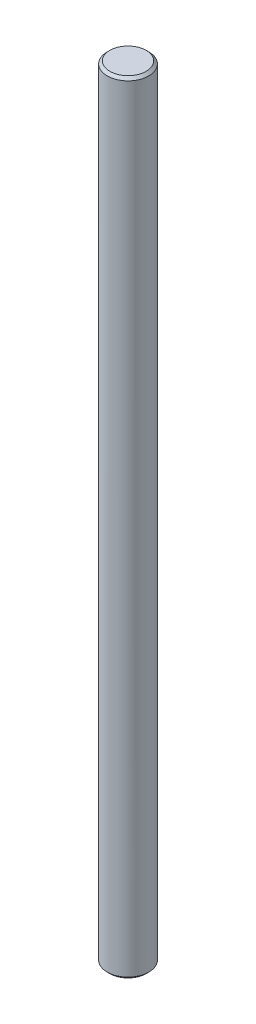
ISO-10303-21;
HEADER;
FILE_DESCRIPTION(('STEP AP214'),'2;1');
FILE_NAME('part.step','',(''),(''),'','','');
FILE_SCHEMA(('AUTOMOTIVE_DESIGN { 1 0 10303 214 1 1 1 1 }'));
ENDSEC;
DATA;
#1=APPLICATION_CONTEXT('core data for automotive mechanical design processes');
#2=APPLICATION_PROTOCOL_DEFINITION('international standard','automotive_design',2000,#1);
#3=PRODUCT_CONTEXT('',#1,'mechanical');
#4=PRODUCT('Part','Part','',(#3));
#5=PRODUCT_RELATED_PRODUCT_CATEGORY('part','',(#4));
#6=PRODUCT_DEFINITION_FORMATION('','',#4);
#7=PRODUCT_DEFINITION_CONTEXT('part definition',#1,'design');
#8=PRODUCT_DEFINITION('design','',#6,#7);
#9=PRODUCT_DEFINITION_SHAPE('','',#8);
#10=(LENGTH_UNIT() NAMED_UNIT(*) SI_UNIT(.MILLI.,.METRE.));
#11=(NAMED_UNIT(*) PLANE_ANGLE_UNIT() SI_UNIT($,.RADIAN.));
#12=(NAMED_UNIT(*) SI_UNIT($,.STERADIAN.) SOLID_ANGLE_UNIT());
#13=UNCERTAINTY_MEASURE_WITH_UNIT(LENGTH_MEASURE(1.E-05),#10,'distance_accuracy_value','');
#14=(GEOMETRIC_REPRESENTATION_CONTEXT(3) GLOBAL_UNCERTAINTY_ASSIGNED_CONTEXT((#13)) GLOBAL_UNIT_ASSIGNED_CONTEXT((#10,
#11,#12)) REPRESENTATION_CONTEXT('',''));
#15=CARTESIAN_POINT('',(0.,0.,0.));
#16=DIRECTION('',(0.,0.,1.));
#17=DIRECTION('',(1.,0.,0.));
#18=AXIS2_PLACEMENT_3D('',#15,#16,#17);
#19=CARTESIAN_POINT('',(0.,150.,0.));
#20=DIRECTION('',(0.,1.,0.));
#21=DIRECTION('',(0.,0.,1.));
#22=AXIS2_PLACEMENT_3D('',#19,#20,#21);
#23=PLANE('',#22);
#24=CARTESIAN_POINT('',(0.,150.000000000034,0.));
#25=DIRECTION('',(0.,-1.,0.));
#26=DIRECTION('',(0.,0.,-1.));
#27=AXIS2_PLACEMENT_3D('',#24,#25,#26);
#28=CIRCLE('',#27,3.48818999992773);
#29=CARTESIAN_POINT('',(0.,150.000000000034,-3.48818999992773));
#30=VERTEX_POINT('',#29);
#31=EDGE_CURVE('E17',#30,#30,#28,.T.);
#32=ORIENTED_EDGE('',*,*,#31,.F.);
#33=EDGE_LOOP('',(#32));
#34=FACE_BOUND('',#33,.T.);
#35=ADVANCED_FACE('F14',(#34),#23,.T.);
#36=CARTESIAN_POINT('',(0.,0.,0.));
#37=DIRECTION('',(0.,1.,0.));
#38=DIRECTION('',(0.,0.,1.));
#39=AXIS2_PLACEMENT_3D('',#36,#37,#38);
#40=PLANE('',#39);
#41=CARTESIAN_POINT('',(0.,0.,0.));
#42=DIRECTION('',(0.,1.,0.));
#43=DIRECTION('',(0.,0.,1.));
#44=AXIS2_PLACEMENT_3D('',#41,#42,#43);
#45=CIRCLE('',#44,3.48818999998457);
#46=CARTESIAN_POINT('',(0.,0.,3.48818999998457));
#47=VERTEX_POINT('',#46);
#48=EDGE_CURVE('E26',#47,#47,#45,.T.);
#49=ORIENTED_EDGE('',*,*,#48,.F.);
#50=EDGE_LOOP('',(#49));
#51=FACE_BOUND('',#50,.T.);
#52=ADVANCED_FACE('F37',(#51),#40,.F.);
#53=CARTESIAN_POINT('',(0.,149.491999999952,0.));
#54=DIRECTION('',(0.,-1.,0.));
#55=DIRECTION('',(0.,0.,-1.));
#56=AXIS2_PLACEMENT_3D('',#53,#54,#55);
#57=CONICAL_SURFACE('',#56,3.99619000000939,0.785398163397448);
#58=CARTESIAN_POINT('',(0.,149.492,0.));
#59=DIRECTION('',(0.,-1.,0.));
#60=DIRECTION('',(0.,0.,-1.));
#61=AXIS2_PLACEMENT_3D('',#58,#59,#60);
#62=CIRCLE('',#61,3.99619);
#63=CARTESIAN_POINT('',(0.,149.492,-3.99619));
#64=VERTEX_POINT('',#63);
#65=EDGE_CURVE('E21',#64,#64,#62,.T.);
#66=ORIENTED_EDGE('',*,*,#65,.F.);
#67=EDGE_LOOP('',(#66));
#68=FACE_BOUND('',#67,.T.);
#69=ORIENTED_EDGE('',*,*,#31,.T.);
#70=EDGE_LOOP('',(#69));
#71=FACE_BOUND('',#70,.T.);
#72=ADVANCED_FACE('F34',(#68,#71),#57,.T.);
#73=CARTESIAN_POINT('',(0.,0.507999999967979,0.));
#74=DIRECTION('',(0.,1.,0.));
#75=DIRECTION('',(0.,0.,1.));
#76=AXIS2_PLACEMENT_3D('',#73,#74,#75);
#77=CONICAL_SURFACE('',#76,3.99618999995255,0.785398163397448);
#78=CARTESIAN_POINT('',(0.,0.507999999999953,0.));
#79=DIRECTION('',(0.,-1.,0.));
#80=DIRECTION('',(0.,0.,-1.));
#81=AXIS2_PLACEMENT_3D('',#78,#79,#80);
#82=CIRCLE('',#81,3.99619);
#83=CARTESIAN_POINT('',(0.,0.507999999999953,-3.99619));
#84=VERTEX_POINT('',#83);
#85=EDGE_CURVE('E10',#84,#84,#82,.F.);
#86=ORIENTED_EDGE('',*,*,#85,.F.);
#87=EDGE_LOOP('',(#86));
#88=FACE_BOUND('',#87,.T.);
#89=ORIENTED_EDGE('',*,*,#48,.T.);
#90=EDGE_LOOP('',(#89));
#91=FACE_BOUND('',#90,.T.);
#92=ADVANCED_FACE('F45',(#88,#91),#77,.T.);
#93=CARTESIAN_POINT('',(0.,150.,0.));
#94=DIRECTION('',(0.,-1.,0.));
#95=DIRECTION('',(0.,0.,-1.));
#96=AXIS2_PLACEMENT_3D('',#93,#94,#95);
#97=CYLINDRICAL_SURFACE('',#96,3.99619);
#98=ORIENTED_EDGE('',*,*,#85,.T.);
#99=EDGE_LOOP('',(#98));
#100=FACE_BOUND('',#99,.T.);
#101=ORIENTED_EDGE('',*,*,#65,.T.);
#102=EDGE_LOOP('',(#101));
#103=FACE_BOUND('',#102,.T.);
#104=ADVANCED_FACE('F43',(#100,#103),#97,.T.);
#105=CLOSED_SHELL('',(#35,#52,#72,#92,#104));
#106=MANIFOLD_SOLID_BREP('B1',#105);
#107=ADVANCED_BREP_SHAPE_REPRESENTATION('',(#18,#106),#14);
#108=SHAPE_DEFINITION_REPRESENTATION(#9,#107);
ENDSEC;
END-ISO-10303-21;
